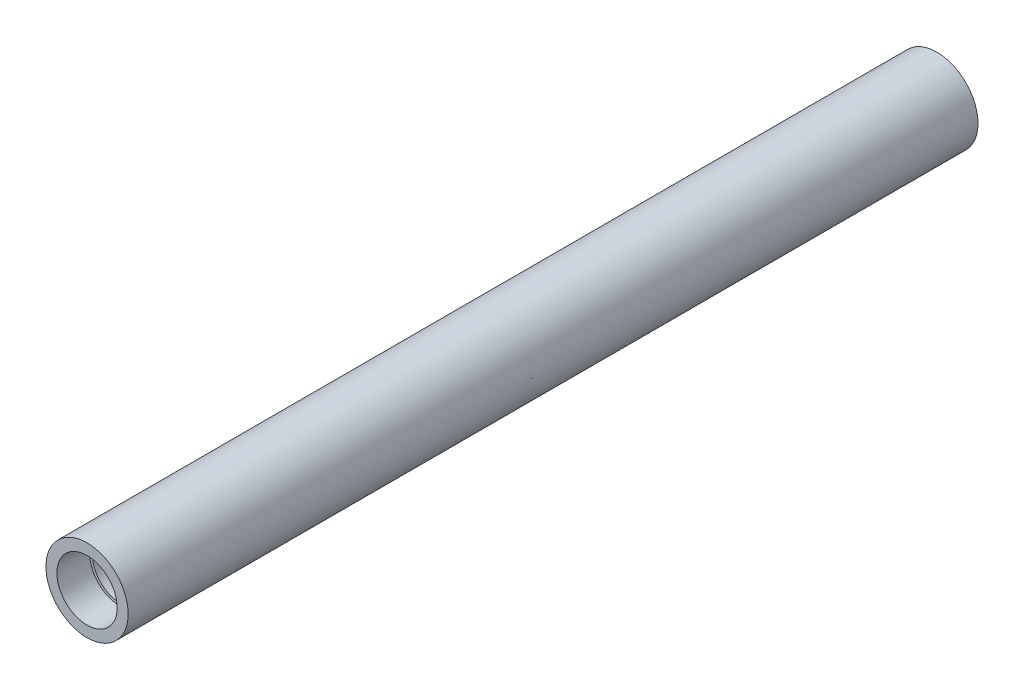
ISO-10303-21;
HEADER;
FILE_DESCRIPTION(('STEP AP214'),'2;1');
FILE_NAME('part.step','',(''),(''),'','','');
FILE_SCHEMA(('AUTOMOTIVE_DESIGN { 1 0 10303 214 1 1 1 1 }'));
ENDSEC;
DATA;
#1=APPLICATION_CONTEXT('core data for automotive mechanical design processes');
#2=APPLICATION_PROTOCOL_DEFINITION('international standard','automotive_design',2000,#1);
#3=PRODUCT_CONTEXT('',#1,'mechanical');
#4=PRODUCT('Part','Part','',(#3));
#5=PRODUCT_RELATED_PRODUCT_CATEGORY('part','',(#4));
#6=PRODUCT_DEFINITION_FORMATION('','',#4);
#7=PRODUCT_DEFINITION_CONTEXT('part definition',#1,'design');
#8=PRODUCT_DEFINITION('design','',#6,#7);
#9=PRODUCT_DEFINITION_SHAPE('','',#8);
#10=(LENGTH_UNIT() NAMED_UNIT(*) SI_UNIT(.MILLI.,.METRE.));
#11=(NAMED_UNIT(*) PLANE_ANGLE_UNIT() SI_UNIT($,.RADIAN.));
#12=(NAMED_UNIT(*) SI_UNIT($,.STERADIAN.) SOLID_ANGLE_UNIT());
#13=UNCERTAINTY_MEASURE_WITH_UNIT(LENGTH_MEASURE(1.E-05),#10,'distance_accuracy_value','');
#14=(GEOMETRIC_REPRESENTATION_CONTEXT(3) GLOBAL_UNCERTAINTY_ASSIGNED_CONTEXT((#13)) GLOBAL_UNIT_ASSIGNED_CONTEXT((#10,
#11,#12)) REPRESENTATION_CONTEXT('',''));
#15=CARTESIAN_POINT('',(0.,0.,0.));
#16=DIRECTION('',(0.,0.,1.));
#17=DIRECTION('',(1.,0.,0.));
#18=AXIS2_PLACEMENT_3D('',#15,#16,#17);
#19=CARTESIAN_POINT('',(0.,0.,310.));
#20=DIRECTION('',(0.,0.,-1.));
#21=DIRECTION('',(-1.,0.,0.));
#22=AXIS2_PLACEMENT_3D('',#19,#20,#21);
#23=CYLINDRICAL_SURFACE('',#22,10.);
#24=CARTESIAN_POINT('',(0.,0.,7.));
#25=DIRECTION('',(0.,0.,-1.));
#26=DIRECTION('',(-1.,0.,0.));
#27=AXIS2_PLACEMENT_3D('',#24,#25,#26);
#28=CIRCLE('',#27,10.);
#29=CARTESIAN_POINT('',(-10.,0.,7.));
#30=VERTEX_POINT('',#29);
#31=EDGE_CURVE('E47',#30,#30,#28,.T.);
#32=ORIENTED_EDGE('',*,*,#31,.T.);
#33=EDGE_LOOP('',(#32));
#34=FACE_BOUND('',#33,.T.);
#35=CARTESIAN_POINT('',(0.,0.,298.));
#36=DIRECTION('',(0.,0.,1.));
#37=DIRECTION('',(1.,0.,0.));
#38=AXIS2_PLACEMENT_3D('',#35,#36,#37);
#39=CIRCLE('',#38,10.);
#40=CARTESIAN_POINT('',(10.,0.,298.));
#41=VERTEX_POINT('',#40);
#42=EDGE_CURVE('E56',#41,#41,#39,.F.);
#43=ORIENTED_EDGE('',*,*,#42,.F.);
#44=EDGE_LOOP('',(#43));
#45=FACE_BOUND('',#44,.T.);
#46=ADVANCED_FACE('F31',(#34,#45),#23,.F.);
#47=CARTESIAN_POINT('',(0.,0.,310.));
#48=DIRECTION('',(0.,0.,1.));
#49=DIRECTION('',(1.,0.,0.));
#50=AXIS2_PLACEMENT_3D('',#47,#48,#49);
#51=PLANE('',#50);
#52=CARTESIAN_POINT('',(0.,0.,310.));
#53=DIRECTION('',(0.,0.,1.));
#54=DIRECTION('',(1.,0.,0.));
#55=AXIS2_PLACEMENT_3D('',#52,#53,#54);
#56=CIRCLE('',#55,11.);
#57=CARTESIAN_POINT('',(11.,0.,310.));
#58=VERTEX_POINT('',#57);
#59=EDGE_CURVE('E53',#58,#58,#56,.T.);
#60=ORIENTED_EDGE('',*,*,#59,.F.);
#61=EDGE_LOOP('',(#60));
#62=FACE_BOUND('',#61,.T.);
#63=CARTESIAN_POINT('',(0.,0.,310.));
#64=DIRECTION('',(0.,0.,1.));
#65=DIRECTION('',(1.,0.,0.));
#66=AXIS2_PLACEMENT_3D('',#63,#64,#65);
#67=CIRCLE('',#66,15.);
#68=CARTESIAN_POINT('',(15.,0.,310.));
#69=VERTEX_POINT('',#68);
#70=EDGE_CURVE('E10',#69,#69,#67,.T.);
#71=ORIENTED_EDGE('',*,*,#70,.T.);
#72=EDGE_LOOP('',(#71));
#73=FACE_BOUND('',#72,.T.);
#74=ADVANCED_FACE('F66',(#62,#73),#51,.T.);
#75=CARTESIAN_POINT('',(0.,0.,0.));
#76=DIRECTION('',(0.,0.,1.));
#77=DIRECTION('',(1.,0.,0.));
#78=AXIS2_PLACEMENT_3D('',#75,#76,#77);
#79=PLANE('',#78);
#80=CARTESIAN_POINT('',(0.,0.,0.));
#81=DIRECTION('',(0.,0.,-1.));
#82=DIRECTION('',(-1.,0.,0.));
#83=AXIS2_PLACEMENT_3D('',#80,#81,#82);
#84=CIRCLE('',#83,13.);
#85=CARTESIAN_POINT('',(-13.,0.,0.));
#86=VERTEX_POINT('',#85);
#87=EDGE_CURVE('E44',#86,#86,#84,.T.);
#88=ORIENTED_EDGE('',*,*,#87,.F.);
#89=EDGE_LOOP('',(#88));
#90=FACE_BOUND('',#89,.T.);
#91=CARTESIAN_POINT('',(0.,0.,0.));
#92=DIRECTION('',(0.,0.,1.));
#93=DIRECTION('',(1.,0.,0.));
#94=AXIS2_PLACEMENT_3D('',#91,#92,#93);
#95=CIRCLE('',#94,15.);
#96=CARTESIAN_POINT('',(15.,0.,0.));
#97=VERTEX_POINT('',#96);
#98=EDGE_CURVE('E35',#97,#97,#95,.T.);
#99=ORIENTED_EDGE('',*,*,#98,.F.);
#100=EDGE_LOOP('',(#99));
#101=FACE_BOUND('',#100,.T.);
#102=ADVANCED_FACE('F72',(#90,#101),#79,.F.);
#103=CARTESIAN_POINT('',(0.,0.,310.));
#104=DIRECTION('',(0.,0.,-1.));
#105=DIRECTION('',(-1.,0.,0.));
#106=AXIS2_PLACEMENT_3D('',#103,#104,#105);
#107=CYLINDRICAL_SURFACE('',#106,15.);
#108=ORIENTED_EDGE('',*,*,#70,.F.);
#109=EDGE_LOOP('',(#108));
#110=FACE_BOUND('',#109,.T.);
#111=ORIENTED_EDGE('',*,*,#98,.T.);
#112=EDGE_LOOP('',(#111));
#113=FACE_BOUND('',#112,.T.);
#114=ADVANCED_FACE('F33',(#110,#113),#107,.T.);
#115=CARTESIAN_POINT('',(0.,0.,7.));
#116=DIRECTION('',(0.,0.,-1.));
#117=DIRECTION('',(-1.,0.,0.));
#118=AXIS2_PLACEMENT_3D('',#115,#116,#117);
#119=CYLINDRICAL_SURFACE('',#118,13.);
#120=CARTESIAN_POINT('',(0.,0.,7.));
#121=DIRECTION('',(0.,0.,-1.));
#122=DIRECTION('',(-1.,0.,0.));
#123=AXIS2_PLACEMENT_3D('',#120,#121,#122);
#124=CIRCLE('',#123,13.);
#125=CARTESIAN_POINT('',(-13.,0.,7.));
#126=VERTEX_POINT('',#125);
#127=EDGE_CURVE('E42',#126,#126,#124,.T.);
#128=ORIENTED_EDGE('',*,*,#127,.F.);
#129=EDGE_LOOP('',(#128));
#130=FACE_BOUND('',#129,.T.);
#131=ORIENTED_EDGE('',*,*,#87,.T.);
#132=EDGE_LOOP('',(#131));
#133=FACE_BOUND('',#132,.T.);
#134=ADVANCED_FACE('F76',(#130,#133),#119,.F.);
#135=CARTESIAN_POINT('',(0.,0.,7.));
#136=DIRECTION('',(0.,0.,-1.));
#137=DIRECTION('',(-1.,0.,0.));
#138=AXIS2_PLACEMENT_3D('',#135,#136,#137);
#139=PLANE('',#138);
#140=ORIENTED_EDGE('',*,*,#31,.F.);
#141=EDGE_LOOP('',(#140));
#142=FACE_BOUND('',#141,.T.);
#143=ORIENTED_EDGE('',*,*,#127,.T.);
#144=EDGE_LOOP('',(#143));
#145=FACE_BOUND('',#144,.T.);
#146=ADVANCED_FACE('F90',(#142,#145),#139,.T.);
#147=CARTESIAN_POINT('',(0.,0.,298.));
#148=DIRECTION('',(0.,0.,1.));
#149=DIRECTION('',(1.,0.,0.));
#150=AXIS2_PLACEMENT_3D('',#147,#148,#149);
#151=CYLINDRICAL_SURFACE('',#150,11.);
#152=CARTESIAN_POINT('',(0.,0.,298.));
#153=DIRECTION('',(0.,0.,1.));
#154=DIRECTION('',(1.,0.,0.));
#155=AXIS2_PLACEMENT_3D('',#152,#153,#154);
#156=CIRCLE('',#155,11.);
#157=CARTESIAN_POINT('',(11.,0.,298.));
#158=VERTEX_POINT('',#157);
#159=EDGE_CURVE('E52',#158,#158,#156,.T.);
#160=ORIENTED_EDGE('',*,*,#159,.F.);
#161=EDGE_LOOP('',(#160));
#162=FACE_BOUND('',#161,.T.);
#163=ORIENTED_EDGE('',*,*,#59,.T.);
#164=EDGE_LOOP('',(#163));
#165=FACE_BOUND('',#164,.T.);
#166=ADVANCED_FACE('F95',(#162,#165),#151,.F.);
#167=CARTESIAN_POINT('',(0.,0.,298.));
#168=DIRECTION('',(0.,0.,1.));
#169=DIRECTION('',(1.,0.,0.));
#170=AXIS2_PLACEMENT_3D('',#167,#168,#169);
#171=PLANE('',#170);
#172=ORIENTED_EDGE('',*,*,#42,.T.);
#173=EDGE_LOOP('',(#172));
#174=FACE_BOUND('',#173,.T.);
#175=ORIENTED_EDGE('',*,*,#159,.T.);
#176=EDGE_LOOP('',(#175));
#177=FACE_BOUND('',#176,.T.);
#178=ADVANCED_FACE('F62',(#174,#177),#171,.T.);
#179=CLOSED_SHELL('',(#46,#74,#102,#114,#134,#146,#166,#178));
#180=MANIFOLD_SOLID_BREP('B2',#179);
#181=ADVANCED_BREP_SHAPE_REPRESENTATION('',(#18,#180),#14);
#182=SHAPE_DEFINITION_REPRESENTATION(#9,#181);
ENDSEC;
END-ISO-10303-21;
